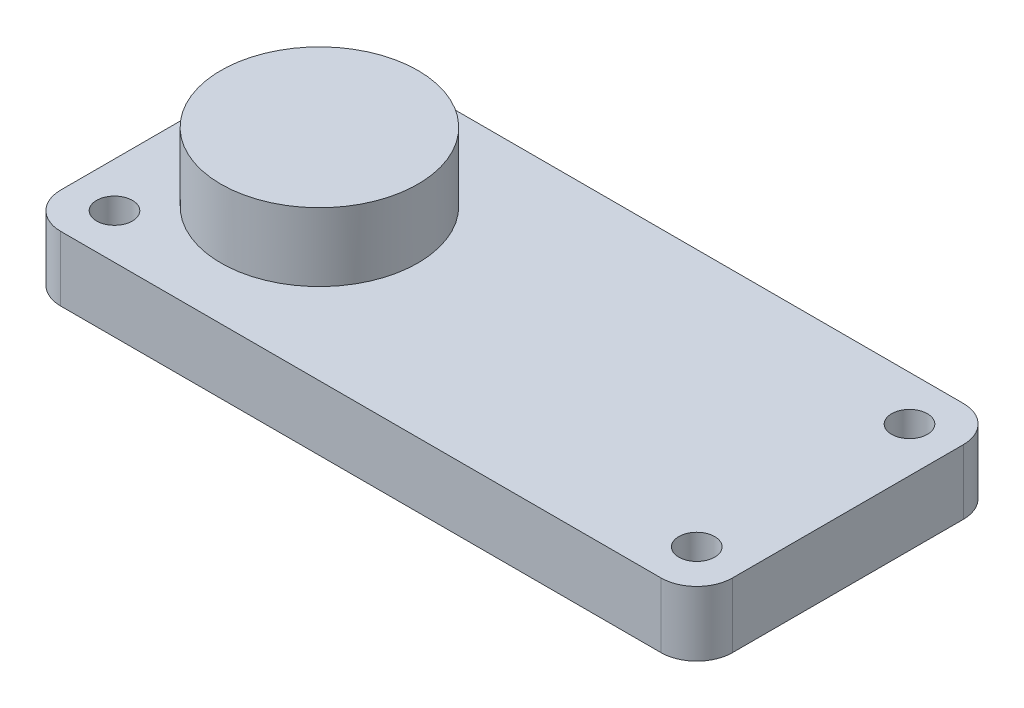
ISO-10303-21;
HEADER;
FILE_DESCRIPTION(('STEP AP214'),'2;1');
FILE_NAME('part.step','',(''),(''),'','','');
FILE_SCHEMA(('AUTOMOTIVE_DESIGN { 1 0 10303 214 1 1 1 1 }'));
ENDSEC;
DATA;
#1=APPLICATION_CONTEXT('core data for automotive mechanical design processes');
#2=APPLICATION_PROTOCOL_DEFINITION('international standard','automotive_design',2000,#1);
#3=PRODUCT_CONTEXT('',#1,'mechanical');
#4=PRODUCT('Part','Part','',(#3));
#5=PRODUCT_RELATED_PRODUCT_CATEGORY('part','',(#4));
#6=PRODUCT_DEFINITION_FORMATION('','',#4);
#7=PRODUCT_DEFINITION_CONTEXT('part definition',#1,'design');
#8=PRODUCT_DEFINITION('design','',#6,#7);
#9=PRODUCT_DEFINITION_SHAPE('','',#8);
#10=(LENGTH_UNIT() NAMED_UNIT(*) SI_UNIT(.MILLI.,.METRE.));
#11=(NAMED_UNIT(*) PLANE_ANGLE_UNIT() SI_UNIT($,.RADIAN.));
#12=(NAMED_UNIT(*) SI_UNIT($,.STERADIAN.) SOLID_ANGLE_UNIT());
#13=UNCERTAINTY_MEASURE_WITH_UNIT(LENGTH_MEASURE(1.E-05),#10,'distance_accuracy_value','');
#14=(GEOMETRIC_REPRESENTATION_CONTEXT(3) GLOBAL_UNCERTAINTY_ASSIGNED_CONTEXT((#13)) GLOBAL_UNIT_ASSIGNED_CONTEXT((#10,
#11,#12)) REPRESENTATION_CONTEXT('',''));
#15=CARTESIAN_POINT('',(0.,0.,0.));
#16=DIRECTION('',(0.,0.,1.));
#17=DIRECTION('',(1.,0.,0.));
#18=AXIS2_PLACEMENT_3D('',#15,#16,#17);
#19=CARTESIAN_POINT('',(26.8,5.78,-10.3));
#20=DIRECTION('',(0.,-1.,0.));
#21=DIRECTION('',(0.,0.,-1.));
#22=AXIS2_PLACEMENT_3D('',#19,#20,#21);
#23=PLANE('',#22);
#24=CARTESIAN_POINT('',(-17.2,5.78,0.));
#25=DIRECTION('',(0.,-1.,0.));
#26=DIRECTION('',(0.,0.,-1.));
#27=AXIS2_PLACEMENT_3D('',#24,#25,#26);
#28=CIRCLE('',#27,8.80000000000004);
#29=CARTESIAN_POINT('',(-17.2,5.78,-8.80000000000004));
#30=VERTEX_POINT('',#29);
#31=EDGE_CURVE('E11',#30,#30,#28,.F.);
#32=ORIENTED_EDGE('',*,*,#31,.F.);
#33=EDGE_LOOP('',(#32));
#34=FACE_BOUND('',#33,.T.);
#35=CARTESIAN_POINT('',(26.8,5.78,-10.3));
#36=DIRECTION('',(0.,1.,0.));
#37=DIRECTION('',(0.,0.,-1.));
#38=AXIS2_PLACEMENT_3D('',#35,#36,#37);
#39=CIRCLE('',#38,3.2);
#40=CARTESIAN_POINT('',(30.,5.78,-10.3));
#41=VERTEX_POINT('',#40);
#42=CARTESIAN_POINT('',(26.8,5.78,-13.5));
#43=VERTEX_POINT('',#42);
#44=EDGE_CURVE('E150',#41,#43,#39,.T.);
#45=ORIENTED_EDGE('',*,*,#44,.T.);
#46=DIRECTION('',(-1.,0.,0.));
#47=VECTOR('',#46,1.);
#48=CARTESIAN_POINT('',(-26.8,5.78,-13.5));
#49=LINE('',#48,#47);
#50=CARTESIAN_POINT('',(-26.8,5.78,-13.5));
#51=VERTEX_POINT('',#50);
#52=EDGE_CURVE('E98',#43,#51,#49,.T.);
#53=ORIENTED_EDGE('',*,*,#52,.T.);
#54=CARTESIAN_POINT('',(-26.8,5.78,-10.3));
#55=DIRECTION('',(0.,1.,0.));
#56=DIRECTION('',(0.,0.,-1.));
#57=AXIS2_PLACEMENT_3D('',#54,#55,#56);
#58=CIRCLE('',#57,3.2);
#59=CARTESIAN_POINT('',(-30.,5.78,-10.3));
#60=VERTEX_POINT('',#59);
#61=EDGE_CURVE('E182',#51,#60,#58,.T.);
#62=ORIENTED_EDGE('',*,*,#61,.T.);
#63=DIRECTION('',(0.,0.,1.));
#64=VECTOR('',#63,1.);
#65=CARTESIAN_POINT('',(-30.,5.78,10.3));
#66=LINE('',#65,#64);
#67=CARTESIAN_POINT('',(-30.,5.78,10.3));
#68=VERTEX_POINT('',#67);
#69=EDGE_CURVE('E181',#60,#68,#66,.T.);
#70=ORIENTED_EDGE('',*,*,#69,.T.);
#71=CARTESIAN_POINT('',(-26.8,5.78,10.3));
#72=DIRECTION('',(0.,1.,0.));
#73=DIRECTION('',(0.,0.,-1.));
#74=AXIS2_PLACEMENT_3D('',#71,#72,#73);
#75=CIRCLE('',#74,3.2);
#76=CARTESIAN_POINT('',(-26.8,5.78,13.5));
#77=VERTEX_POINT('',#76);
#78=EDGE_CURVE('E117',#68,#77,#75,.T.);
#79=ORIENTED_EDGE('',*,*,#78,.T.);
#80=DIRECTION('',(1.,0.,0.));
#81=VECTOR('',#80,1.);
#82=CARTESIAN_POINT('',(-26.8,5.78,13.5));
#83=LINE('',#82,#81);
#84=CARTESIAN_POINT('',(26.8,5.78,13.5));
#85=VERTEX_POINT('',#84);
#86=EDGE_CURVE('E111',#77,#85,#83,.T.);
#87=ORIENTED_EDGE('',*,*,#86,.T.);
#88=CARTESIAN_POINT('',(26.8,5.78,10.3));
#89=DIRECTION('',(0.,1.,0.));
#90=DIRECTION('',(0.,0.,1.));
#91=AXIS2_PLACEMENT_3D('',#88,#89,#90);
#92=CIRCLE('',#91,3.2);
#93=CARTESIAN_POINT('',(30.,5.78,10.3));
#94=VERTEX_POINT('',#93);
#95=EDGE_CURVE('E115',#85,#94,#92,.T.);
#96=ORIENTED_EDGE('',*,*,#95,.T.);
#97=DIRECTION('',(0.,0.,-1.));
#98=VECTOR('',#97,1.);
#99=CARTESIAN_POINT('',(30.,5.78,10.3));
#100=LINE('',#99,#98);
#101=EDGE_CURVE('E54',#94,#41,#100,.T.);
#102=ORIENTED_EDGE('',*,*,#101,.T.);
#103=EDGE_LOOP('',(#45,#53,#62,#70,#79,#87,#96,#102));
#104=FACE_BOUND('',#103,.T.);
#105=CARTESIAN_POINT('',(26.0000000000001,5.78,-9.50000000000003));
#106=DIRECTION('',(0.,1.,0.));
#107=DIRECTION('',(0.,0.,1.));
#108=AXIS2_PLACEMENT_3D('',#105,#106,#107);
#109=CIRCLE('',#108,1.6);
#110=CARTESIAN_POINT('',(26.0000000000001,5.78,-7.90000000000003));
#111=VERTEX_POINT('',#110);
#112=EDGE_CURVE('E139',#111,#111,#109,.T.);
#113=ORIENTED_EDGE('',*,*,#112,.F.);
#114=EDGE_LOOP('',(#113));
#115=FACE_BOUND('',#114,.T.);
#116=CARTESIAN_POINT('',(-26.,5.78,-9.50000000000003));
#117=DIRECTION('',(0.,1.,0.));
#118=DIRECTION('',(0.,0.,1.));
#119=AXIS2_PLACEMENT_3D('',#116,#117,#118);
#120=CIRCLE('',#119,1.6);
#121=CARTESIAN_POINT('',(-26.,5.78,-7.90000000000003));
#122=VERTEX_POINT('',#121);
#123=EDGE_CURVE('E191',#122,#122,#120,.T.);
#124=ORIENTED_EDGE('',*,*,#123,.F.);
#125=EDGE_LOOP('',(#124));
#126=FACE_BOUND('',#125,.T.);
#127=CARTESIAN_POINT('',(-26.,5.78,9.5));
#128=DIRECTION('',(0.,1.,0.));
#129=DIRECTION('',(0.,0.,1.));
#130=AXIS2_PLACEMENT_3D('',#127,#128,#129);
#131=CIRCLE('',#130,1.6);
#132=CARTESIAN_POINT('',(-26.,5.78,11.1));
#133=VERTEX_POINT('',#132);
#134=EDGE_CURVE('E197',#133,#133,#131,.T.);
#135=ORIENTED_EDGE('',*,*,#134,.F.);
#136=EDGE_LOOP('',(#135));
#137=FACE_BOUND('',#136,.T.);
#138=CARTESIAN_POINT('',(26.0000000000001,5.78,9.5));
#139=DIRECTION('',(0.,1.,0.));
#140=DIRECTION('',(0.,0.,1.));
#141=AXIS2_PLACEMENT_3D('',#138,#139,#140);
#142=CIRCLE('',#141,1.6);
#143=CARTESIAN_POINT('',(26.0000000000001,5.78,11.1));
#144=VERTEX_POINT('',#143);
#145=EDGE_CURVE('E203',#144,#144,#142,.T.);
#146=ORIENTED_EDGE('',*,*,#145,.F.);
#147=EDGE_LOOP('',(#146));
#148=FACE_BOUND('',#147,.T.);
#149=ADVANCED_FACE('F37',(#34,#104,#115,#126,#137,#148),#23,.F.);
#150=CARTESIAN_POINT('',(26.8,0.,-10.3));
#151=DIRECTION('',(0.,-1.,0.));
#152=DIRECTION('',(0.,0.,-1.));
#153=AXIS2_PLACEMENT_3D('',#150,#151,#152);
#154=PLANE('',#153);
#155=CARTESIAN_POINT('',(-26.,0.,9.5));
#156=DIRECTION('',(0.,1.,0.));
#157=DIRECTION('',(0.,0.,1.));
#158=AXIS2_PLACEMENT_3D('',#155,#156,#157);
#159=CIRCLE('',#158,1.6);
#160=CARTESIAN_POINT('',(-26.,0.,11.1));
#161=VERTEX_POINT('',#160);
#162=EDGE_CURVE('E200',#161,#161,#159,.T.);
#163=ORIENTED_EDGE('',*,*,#162,.T.);
#164=EDGE_LOOP('',(#163));
#165=FACE_BOUND('',#164,.T.);
#166=CARTESIAN_POINT('',(26.0000000000001,0.,-9.50000000000003));
#167=DIRECTION('',(0.,1.,0.));
#168=DIRECTION('',(0.,0.,1.));
#169=AXIS2_PLACEMENT_3D('',#166,#167,#168);
#170=CIRCLE('',#169,1.6);
#171=CARTESIAN_POINT('',(26.0000000000001,0.,-7.90000000000003));
#172=VERTEX_POINT('',#171);
#173=EDGE_CURVE('E188',#172,#172,#170,.T.);
#174=ORIENTED_EDGE('',*,*,#173,.T.);
#175=EDGE_LOOP('',(#174));
#176=FACE_BOUND('',#175,.T.);
#177=CARTESIAN_POINT('',(26.8,0.,-10.3));
#178=DIRECTION('',(0.,1.,0.));
#179=DIRECTION('',(0.,0.,-1.));
#180=AXIS2_PLACEMENT_3D('',#177,#178,#179);
#181=CIRCLE('',#180,3.2);
#182=CARTESIAN_POINT('',(30.,0.,-10.3));
#183=VERTEX_POINT('',#182);
#184=CARTESIAN_POINT('',(26.8,0.,-13.5));
#185=VERTEX_POINT('',#184);
#186=EDGE_CURVE('E135',#183,#185,#181,.T.);
#187=ORIENTED_EDGE('',*,*,#186,.F.);
#188=DIRECTION('',(0.,0.,-1.));
#189=VECTOR('',#188,1.);
#190=CARTESIAN_POINT('',(30.,0.,10.3));
#191=LINE('',#190,#189);
#192=CARTESIAN_POINT('',(30.,0.,10.3));
#193=VERTEX_POINT('',#192);
#194=EDGE_CURVE('E89',#193,#183,#191,.T.);
#195=ORIENTED_EDGE('',*,*,#194,.F.);
#196=CARTESIAN_POINT('',(26.8,0.,10.3));
#197=DIRECTION('',(0.,1.,0.));
#198=DIRECTION('',(0.,0.,1.));
#199=AXIS2_PLACEMENT_3D('',#196,#197,#198);
#200=CIRCLE('',#199,3.2);
#201=CARTESIAN_POINT('',(26.8,0.,13.5));
#202=VERTEX_POINT('',#201);
#203=EDGE_CURVE('E83',#202,#193,#200,.T.);
#204=ORIENTED_EDGE('',*,*,#203,.F.);
#205=DIRECTION('',(1.,0.,0.));
#206=VECTOR('',#205,1.);
#207=CARTESIAN_POINT('',(-26.8,0.,13.5));
#208=LINE('',#207,#206);
#209=CARTESIAN_POINT('',(-26.8,0.,13.5));
#210=VERTEX_POINT('',#209);
#211=EDGE_CURVE('E125',#210,#202,#208,.T.);
#212=ORIENTED_EDGE('',*,*,#211,.F.);
#213=CARTESIAN_POINT('',(-26.8,0.,10.3));
#214=DIRECTION('',(0.,1.,0.));
#215=DIRECTION('',(0.,0.,-1.));
#216=AXIS2_PLACEMENT_3D('',#213,#214,#215);
#217=CIRCLE('',#216,3.2);
#218=CARTESIAN_POINT('',(-30.,0.,10.3));
#219=VERTEX_POINT('',#218);
#220=EDGE_CURVE('E145',#219,#210,#217,.T.);
#221=ORIENTED_EDGE('',*,*,#220,.F.);
#222=DIRECTION('',(0.,0.,1.));
#223=VECTOR('',#222,1.);
#224=CARTESIAN_POINT('',(-30.,0.,10.3));
#225=LINE('',#224,#223);
#226=CARTESIAN_POINT('',(-30.,0.,-10.3));
#227=VERTEX_POINT('',#226);
#228=EDGE_CURVE('E143',#227,#219,#225,.T.);
#229=ORIENTED_EDGE('',*,*,#228,.F.);
#230=CARTESIAN_POINT('',(-26.8,0.,-10.3));
#231=DIRECTION('',(0.,1.,0.));
#232=DIRECTION('',(0.,0.,-1.));
#233=AXIS2_PLACEMENT_3D('',#230,#231,#232);
#234=CIRCLE('',#233,3.2);
#235=CARTESIAN_POINT('',(-26.8,0.,-13.5));
#236=VERTEX_POINT('',#235);
#237=EDGE_CURVE('E141',#236,#227,#234,.T.);
#238=ORIENTED_EDGE('',*,*,#237,.F.);
#239=DIRECTION('',(-1.,0.,0.));
#240=VECTOR('',#239,1.);
#241=CARTESIAN_POINT('',(-26.8,0.,-13.5));
#242=LINE('',#241,#240);
#243=EDGE_CURVE('E138',#185,#236,#242,.T.);
#244=ORIENTED_EDGE('',*,*,#243,.F.);
#245=EDGE_LOOP('',(#187,#195,#204,#212,#221,#229,#238,#244));
#246=FACE_BOUND('',#245,.T.);
#247=CARTESIAN_POINT('',(-26.,0.,-9.50000000000003));
#248=DIRECTION('',(0.,1.,0.));
#249=DIRECTION('',(0.,0.,1.));
#250=AXIS2_PLACEMENT_3D('',#247,#248,#249);
#251=CIRCLE('',#250,1.6);
#252=CARTESIAN_POINT('',(-26.,0.,-7.90000000000003));
#253=VERTEX_POINT('',#252);
#254=EDGE_CURVE('E194',#253,#253,#251,.T.);
#255=ORIENTED_EDGE('',*,*,#254,.T.);
#256=EDGE_LOOP('',(#255));
#257=FACE_BOUND('',#256,.T.);
#258=CARTESIAN_POINT('',(26.0000000000001,0.,9.5));
#259=DIRECTION('',(0.,1.,0.));
#260=DIRECTION('',(0.,0.,1.));
#261=AXIS2_PLACEMENT_3D('',#258,#259,#260);
#262=CIRCLE('',#261,1.6);
#263=CARTESIAN_POINT('',(26.0000000000001,0.,11.1));
#264=VERTEX_POINT('',#263);
#265=EDGE_CURVE('E206',#264,#264,#262,.T.);
#266=ORIENTED_EDGE('',*,*,#265,.T.);
#267=EDGE_LOOP('',(#266));
#268=FACE_BOUND('',#267,.T.);
#269=ADVANCED_FACE('F168',(#165,#176,#246,#257,#268),#154,.T.);
#270=CARTESIAN_POINT('',(26.8,5.78,-10.3));
#271=DIRECTION('',(0.,-1.,0.));
#272=DIRECTION('',(0.,0.,-1.));
#273=AXIS2_PLACEMENT_3D('',#270,#271,#272);
#274=CYLINDRICAL_SURFACE('',#273,3.2);
#275=ORIENTED_EDGE('',*,*,#186,.T.);
#276=DIRECTION('',(0.,-1.,0.));
#277=VECTOR('',#276,1.);
#278=CARTESIAN_POINT('',(26.8,5.78,-13.5));
#279=LINE('',#278,#277);
#280=EDGE_CURVE('E46',#43,#185,#279,.T.);
#281=ORIENTED_EDGE('',*,*,#280,.F.);
#282=ORIENTED_EDGE('',*,*,#44,.F.);
#283=DIRECTION('',(0.,-1.,0.));
#284=VECTOR('',#283,1.);
#285=CARTESIAN_POINT('',(30.,5.78,-10.3));
#286=LINE('',#285,#284);
#287=EDGE_CURVE('E131',#41,#183,#286,.T.);
#288=ORIENTED_EDGE('',*,*,#287,.T.);
#289=EDGE_LOOP('',(#275,#281,#282,#288));
#290=FACE_BOUND('',#289,.T.);
#291=ADVANCED_FACE('F39',(#290),#274,.T.);
#292=CARTESIAN_POINT('',(-26.8,5.78,-13.5));
#293=DIRECTION('',(0.,0.,1.));
#294=DIRECTION('',(1.,0.,0.));
#295=AXIS2_PLACEMENT_3D('',#292,#293,#294);
#296=PLANE('',#295);
#297=ORIENTED_EDGE('',*,*,#243,.T.);
#298=DIRECTION('',(0.,-1.,0.));
#299=VECTOR('',#298,1.);
#300=CARTESIAN_POINT('',(-26.8,5.78,-13.5));
#301=LINE('',#300,#299);
#302=EDGE_CURVE('E160',#51,#236,#301,.T.);
#303=ORIENTED_EDGE('',*,*,#302,.F.);
#304=ORIENTED_EDGE('',*,*,#52,.F.);
#305=ORIENTED_EDGE('',*,*,#280,.T.);
#306=EDGE_LOOP('',(#297,#303,#304,#305));
#307=FACE_BOUND('',#306,.T.);
#308=ADVANCED_FACE('F163',(#307),#296,.F.);
#309=CARTESIAN_POINT('',(-26.8,5.78,-10.3));
#310=DIRECTION('',(0.,-1.,0.));
#311=DIRECTION('',(0.,0.,-1.));
#312=AXIS2_PLACEMENT_3D('',#309,#310,#311);
#313=CYLINDRICAL_SURFACE('',#312,3.2);
#314=ORIENTED_EDGE('',*,*,#237,.T.);
#315=DIRECTION('',(0.,-1.,0.));
#316=VECTOR('',#315,1.);
#317=CARTESIAN_POINT('',(-30.,5.78,-10.3));
#318=LINE('',#317,#316);
#319=EDGE_CURVE('E157',#60,#227,#318,.T.);
#320=ORIENTED_EDGE('',*,*,#319,.F.);
#321=ORIENTED_EDGE('',*,*,#61,.F.);
#322=ORIENTED_EDGE('',*,*,#302,.T.);
#323=EDGE_LOOP('',(#314,#320,#321,#322));
#324=FACE_BOUND('',#323,.T.);
#325=ADVANCED_FACE('F175',(#324),#313,.T.);
#326=CARTESIAN_POINT('',(-30.,5.78,10.3));
#327=DIRECTION('',(1.,0.,0.));
#328=DIRECTION('',(0.,0.,-1.));
#329=AXIS2_PLACEMENT_3D('',#326,#327,#328);
#330=PLANE('',#329);
#331=ORIENTED_EDGE('',*,*,#228,.T.);
#332=DIRECTION('',(0.,-1.,0.));
#333=VECTOR('',#332,1.);
#334=CARTESIAN_POINT('',(-30.,5.78,10.3));
#335=LINE('',#334,#333);
#336=EDGE_CURVE('E154',#68,#219,#335,.T.);
#337=ORIENTED_EDGE('',*,*,#336,.F.);
#338=ORIENTED_EDGE('',*,*,#69,.F.);
#339=ORIENTED_EDGE('',*,*,#319,.T.);
#340=EDGE_LOOP('',(#331,#337,#338,#339));
#341=FACE_BOUND('',#340,.T.);
#342=ADVANCED_FACE('F179',(#341),#330,.F.);
#343=CARTESIAN_POINT('',(-26.8,5.78,10.3));
#344=DIRECTION('',(0.,-1.,0.));
#345=DIRECTION('',(0.,0.,-1.));
#346=AXIS2_PLACEMENT_3D('',#343,#344,#345);
#347=CYLINDRICAL_SURFACE('',#346,3.2);
#348=ORIENTED_EDGE('',*,*,#220,.T.);
#349=DIRECTION('',(0.,-1.,0.));
#350=VECTOR('',#349,1.);
#351=CARTESIAN_POINT('',(-26.8,5.78,13.5));
#352=LINE('',#351,#350);
#353=EDGE_CURVE('E126',#77,#210,#352,.T.);
#354=ORIENTED_EDGE('',*,*,#353,.F.);
#355=ORIENTED_EDGE('',*,*,#78,.F.);
#356=ORIENTED_EDGE('',*,*,#336,.T.);
#357=EDGE_LOOP('',(#348,#354,#355,#356));
#358=FACE_BOUND('',#357,.T.);
#359=ADVANCED_FACE('F242',(#358),#347,.T.);
#360=CARTESIAN_POINT('',(-26.8,5.78,13.5));
#361=DIRECTION('',(0.,0.,-1.));
#362=DIRECTION('',(-1.,0.,0.));
#363=AXIS2_PLACEMENT_3D('',#360,#361,#362);
#364=PLANE('',#363);
#365=ORIENTED_EDGE('',*,*,#211,.T.);
#366=DIRECTION('',(0.,-1.,0.));
#367=VECTOR('',#366,1.);
#368=CARTESIAN_POINT('',(26.8,5.78,13.5));
#369=LINE('',#368,#367);
#370=EDGE_CURVE('E122',#85,#202,#369,.T.);
#371=ORIENTED_EDGE('',*,*,#370,.F.);
#372=ORIENTED_EDGE('',*,*,#86,.F.);
#373=ORIENTED_EDGE('',*,*,#353,.T.);
#374=EDGE_LOOP('',(#365,#371,#372,#373));
#375=FACE_BOUND('',#374,.T.);
#376=ADVANCED_FACE('F123',(#375),#364,.F.);
#377=CARTESIAN_POINT('',(26.8,5.78,10.3));
#378=DIRECTION('',(0.,-1.,0.));
#379=DIRECTION('',(0.,0.,-1.));
#380=AXIS2_PLACEMENT_3D('',#377,#378,#379);
#381=CYLINDRICAL_SURFACE('',#380,3.2);
#382=ORIENTED_EDGE('',*,*,#203,.T.);
#383=DIRECTION('',(0.,-1.,0.));
#384=VECTOR('',#383,1.);
#385=CARTESIAN_POINT('',(30.,5.78,10.3));
#386=LINE('',#385,#384);
#387=EDGE_CURVE('E127',#94,#193,#386,.T.);
#388=ORIENTED_EDGE('',*,*,#387,.F.);
#389=ORIENTED_EDGE('',*,*,#95,.F.);
#390=ORIENTED_EDGE('',*,*,#370,.T.);
#391=EDGE_LOOP('',(#382,#388,#389,#390));
#392=FACE_BOUND('',#391,.T.);
#393=ADVANCED_FACE('F129',(#392),#381,.T.);
#394=CARTESIAN_POINT('',(30.,5.78,10.3));
#395=DIRECTION('',(-1.,0.,0.));
#396=DIRECTION('',(0.,0.,1.));
#397=AXIS2_PLACEMENT_3D('',#394,#395,#396);
#398=PLANE('',#397);
#399=ORIENTED_EDGE('',*,*,#194,.T.);
#400=ORIENTED_EDGE('',*,*,#287,.F.);
#401=ORIENTED_EDGE('',*,*,#101,.F.);
#402=ORIENTED_EDGE('',*,*,#387,.T.);
#403=EDGE_LOOP('',(#399,#400,#401,#402));
#404=FACE_BOUND('',#403,.T.);
#405=ADVANCED_FACE('F235',(#404),#398,.F.);
#406=CARTESIAN_POINT('',(26.0000000000001,5.78,-9.50000000000003));
#407=DIRECTION('',(0.,-1.,0.));
#408=DIRECTION('',(0.,0.,-1.));
#409=AXIS2_PLACEMENT_3D('',#406,#407,#408);
#410=CYLINDRICAL_SURFACE('',#409,1.6);
#411=ORIENTED_EDGE('',*,*,#112,.T.);
#412=EDGE_LOOP('',(#411));
#413=FACE_BOUND('',#412,.T.);
#414=ORIENTED_EDGE('',*,*,#173,.F.);
#415=EDGE_LOOP('',(#414));
#416=FACE_BOUND('',#415,.T.);
#417=ADVANCED_FACE('F232',(#413,#416),#410,.F.);
#418=CARTESIAN_POINT('',(-26.,5.78,-9.50000000000003));
#419=DIRECTION('',(0.,-1.,0.));
#420=DIRECTION('',(0.,0.,-1.));
#421=AXIS2_PLACEMENT_3D('',#418,#419,#420);
#422=CYLINDRICAL_SURFACE('',#421,1.6);
#423=ORIENTED_EDGE('',*,*,#123,.T.);
#424=EDGE_LOOP('',(#423));
#425=FACE_BOUND('',#424,.T.);
#426=ORIENTED_EDGE('',*,*,#254,.F.);
#427=EDGE_LOOP('',(#426));
#428=FACE_BOUND('',#427,.T.);
#429=ADVANCED_FACE('F308',(#425,#428),#422,.F.);
#430=CARTESIAN_POINT('',(-26.,5.78,9.5));
#431=DIRECTION('',(0.,-1.,0.));
#432=DIRECTION('',(0.,0.,-1.));
#433=AXIS2_PLACEMENT_3D('',#430,#431,#432);
#434=CYLINDRICAL_SURFACE('',#433,1.6);
#435=ORIENTED_EDGE('',*,*,#134,.T.);
#436=EDGE_LOOP('',(#435));
#437=FACE_BOUND('',#436,.T.);
#438=ORIENTED_EDGE('',*,*,#162,.F.);
#439=EDGE_LOOP('',(#438));
#440=FACE_BOUND('',#439,.T.);
#441=ADVANCED_FACE('F316',(#437,#440),#434,.F.);
#442=CARTESIAN_POINT('',(26.0000000000001,5.78,9.5));
#443=DIRECTION('',(0.,-1.,0.));
#444=DIRECTION('',(0.,0.,-1.));
#445=AXIS2_PLACEMENT_3D('',#442,#443,#444);
#446=CYLINDRICAL_SURFACE('',#445,1.6);
#447=ORIENTED_EDGE('',*,*,#145,.T.);
#448=EDGE_LOOP('',(#447));
#449=FACE_BOUND('',#448,.T.);
#450=ORIENTED_EDGE('',*,*,#265,.F.);
#451=EDGE_LOOP('',(#450));
#452=FACE_BOUND('',#451,.T.);
#453=ADVANCED_FACE('F220',(#449,#452),#446,.F.);
#454=CARTESIAN_POINT('',(-17.2,11.88,0.));
#455=DIRECTION('',(0.,-1.,0.));
#456=DIRECTION('',(0.,0.,-1.));
#457=AXIS2_PLACEMENT_3D('',#454,#455,#456);
#458=CYLINDRICAL_SURFACE('',#457,8.80000000000004);
#459=CARTESIAN_POINT('',(-17.2,11.88,0.));
#460=DIRECTION('',(0.,1.,0.));
#461=DIRECTION('',(0.,0.,1.));
#462=AXIS2_PLACEMENT_3D('',#459,#460,#461);
#463=CIRCLE('',#462,8.80000000000004);
#464=CARTESIAN_POINT('',(-17.2,11.88,8.80000000000004));
#465=VERTEX_POINT('',#464);
#466=EDGE_CURVE('E209',#465,#465,#463,.T.);
#467=ORIENTED_EDGE('',*,*,#466,.F.);
#468=EDGE_LOOP('',(#467));
#469=FACE_BOUND('',#468,.T.);
#470=ORIENTED_EDGE('',*,*,#31,.T.);
#471=EDGE_LOOP('',(#470));
#472=FACE_BOUND('',#471,.T.);
#473=ADVANCED_FACE('F217',(#469,#472),#458,.T.);
#474=CARTESIAN_POINT('',(-17.2,11.88,0.));
#475=DIRECTION('',(0.,1.,0.));
#476=DIRECTION('',(0.,0.,1.));
#477=AXIS2_PLACEMENT_3D('',#474,#475,#476);
#478=PLANE('',#477);
#479=ORIENTED_EDGE('',*,*,#466,.T.);
#480=EDGE_LOOP('',(#479));
#481=FACE_BOUND('',#480,.T.);
#482=ADVANCED_FACE('F215',(#481),#478,.T.);
#483=CLOSED_SHELL('',(#149,#269,#291,#308,#325,#342,#359,#376,#393,#405,#417,#429,#441,#453,
#473,#482));
#484=MANIFOLD_SOLID_BREP('B2',#483);
#485=ADVANCED_BREP_SHAPE_REPRESENTATION('',(#18,#484),#14);
#486=SHAPE_DEFINITION_REPRESENTATION(#9,#485);
ENDSEC;
END-ISO-10303-21;
